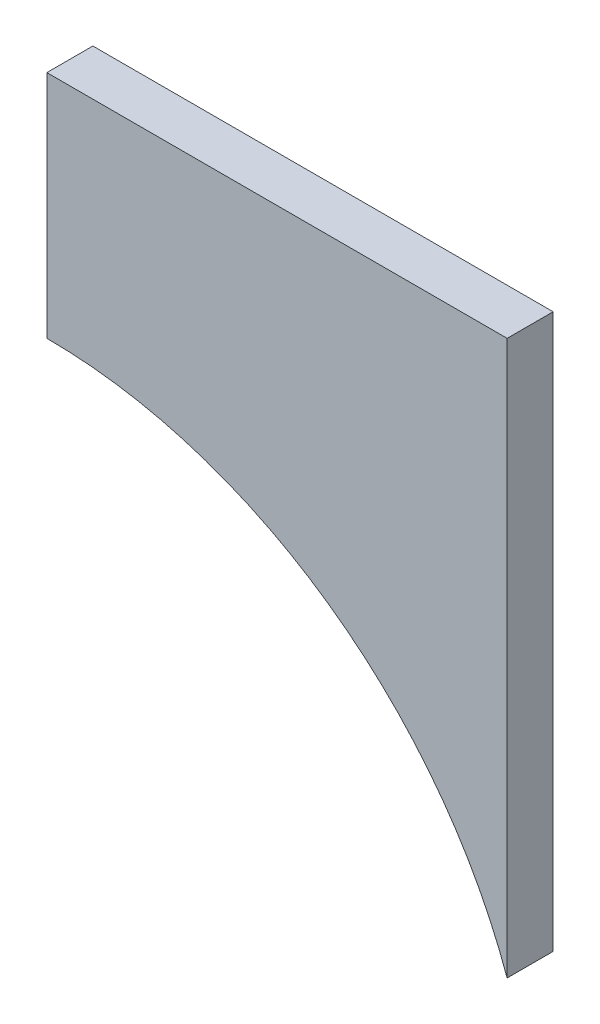
ISO-10303-21;
HEADER;
FILE_DESCRIPTION(('STEP AP214'),'2;1');
FILE_NAME('part.step','',(''),(''),'','','');
FILE_SCHEMA(('AUTOMOTIVE_DESIGN { 1 0 10303 214 1 1 1 1 }'));
ENDSEC;
DATA;
#1=APPLICATION_CONTEXT('core data for automotive mechanical design processes');
#2=APPLICATION_PROTOCOL_DEFINITION('international standard','automotive_design',2000,#1);
#3=PRODUCT_CONTEXT('',#1,'mechanical');
#4=PRODUCT('Part','Part','',(#3));
#5=PRODUCT_RELATED_PRODUCT_CATEGORY('part','',(#4));
#6=PRODUCT_DEFINITION_FORMATION('','',#4);
#7=PRODUCT_DEFINITION_CONTEXT('part definition',#1,'design');
#8=PRODUCT_DEFINITION('design','',#6,#7);
#9=PRODUCT_DEFINITION_SHAPE('','',#8);
#10=(LENGTH_UNIT() NAMED_UNIT(*) SI_UNIT(.MILLI.,.METRE.));
#11=(NAMED_UNIT(*) PLANE_ANGLE_UNIT() SI_UNIT($,.RADIAN.));
#12=(NAMED_UNIT(*) SI_UNIT($,.STERADIAN.) SOLID_ANGLE_UNIT());
#13=UNCERTAINTY_MEASURE_WITH_UNIT(LENGTH_MEASURE(1.E-05),#10,'distance_accuracy_value','');
#14=(GEOMETRIC_REPRESENTATION_CONTEXT(3) GLOBAL_UNCERTAINTY_ASSIGNED_CONTEXT((#13)) GLOBAL_UNIT_ASSIGNED_CONTEXT((#10,
#11,#12)) REPRESENTATION_CONTEXT('',''));
#15=CARTESIAN_POINT('',(0.,0.,0.));
#16=DIRECTION('',(0.,0.,1.));
#17=DIRECTION('',(1.,0.,0.));
#18=AXIS2_PLACEMENT_3D('',#15,#16,#17);
#19=CARTESIAN_POINT('',(-0.2,-0.525,0.));
#20=DIRECTION('',(0.,0.,-1.));
#21=DIRECTION('',(-1.,0.,0.));
#22=AXIS2_PLACEMENT_3D('',#19,#20,#21);
#23=PLANE('',#22);
#24=DIRECTION('',(1.,0.,0.));
#25=VECTOR('',#24,1.);
#26=CARTESIAN_POINT('',(0.2,0.1,0.));
#27=LINE('',#26,#25);
#28=CARTESIAN_POINT('',(-0.2,0.1,0.));
#29=VERTEX_POINT('',#28);
#30=CARTESIAN_POINT('',(0.2,0.1,0.));
#31=VERTEX_POINT('',#30);
#32=EDGE_CURVE('E61',#29,#31,#27,.T.);
#33=ORIENTED_EDGE('',*,*,#32,.T.);
#34=DIRECTION('',(0.,-1.,0.));
#35=VECTOR('',#34,1.);
#36=CARTESIAN_POINT('',(0.2,-0.381385933837,0.));
#37=LINE('',#36,#35);
#38=CARTESIAN_POINT('',(0.200000000000072,-0.381385933836749,0.));
#39=VERTEX_POINT('',#38);
#40=EDGE_CURVE('E50',#31,#39,#37,.T.);
#41=ORIENTED_EDGE('',*,*,#40,.T.);
#42=CARTESIAN_POINT('',(-0.2,-0.525,0.));
#43=DIRECTION('',(0.,0.,1.));
#44=DIRECTION('',(1.,0.,0.));
#45=AXIS2_PLACEMENT_3D('',#42,#43,#44);
#46=CIRCLE('',#45,0.425);
#47=CARTESIAN_POINT('',(-0.2,-0.1,0.));
#48=VERTEX_POINT('',#47);
#49=EDGE_CURVE('E20',#39,#48,#46,.T.);
#50=ORIENTED_EDGE('',*,*,#49,.T.);
#51=DIRECTION('',(0.,1.,0.));
#52=VECTOR('',#51,1.);
#53=CARTESIAN_POINT('',(-0.2,0.1,0.));
#54=LINE('',#53,#52);
#55=EDGE_CURVE('E57',#48,#29,#54,.T.);
#56=ORIENTED_EDGE('',*,*,#55,.T.);
#57=EDGE_LOOP('',(#33,#41,#50,#56));
#58=FACE_BOUND('',#57,.T.);
#59=ADVANCED_FACE('F17',(#58),#23,.T.);
#60=CARTESIAN_POINT('',(-0.2,0.1,0.04));
#61=DIRECTION('',(1.,0.,0.));
#62=DIRECTION('',(0.,0.,-1.));
#63=AXIS2_PLACEMENT_3D('',#60,#61,#62);
#64=PLANE('',#63);
#65=DIRECTION('',(0.,0.,1.));
#66=VECTOR('',#65,1.);
#67=CARTESIAN_POINT('',(-0.2,-0.1,0.04));
#68=LINE('',#67,#66);
#69=CARTESIAN_POINT('',(-0.2,-0.1,0.04));
#70=VERTEX_POINT('',#69);
#71=EDGE_CURVE('E79',#48,#70,#68,.T.);
#72=ORIENTED_EDGE('',*,*,#71,.T.);
#73=DIRECTION('',(0.,1.,0.));
#74=VECTOR('',#73,1.);
#75=CARTESIAN_POINT('',(-0.2,-0.525,0.04));
#76=LINE('',#75,#74);
#77=CARTESIAN_POINT('',(-0.2,0.1,0.04));
#78=VERTEX_POINT('',#77);
#79=EDGE_CURVE('E75',#70,#78,#76,.T.);
#80=ORIENTED_EDGE('',*,*,#79,.T.);
#81=DIRECTION('',(0.,0.,1.));
#82=VECTOR('',#81,1.);
#83=CARTESIAN_POINT('',(-0.2,0.1,0.04));
#84=LINE('',#83,#82);
#85=EDGE_CURVE('E65',#78,#29,#84,.F.);
#86=ORIENTED_EDGE('',*,*,#85,.T.);
#87=ORIENTED_EDGE('',*,*,#55,.F.);
#88=EDGE_LOOP('',(#72,#80,#86,#87));
#89=FACE_BOUND('',#88,.T.);
#90=ADVANCED_FACE('F78',(#89),#64,.F.);
#91=CARTESIAN_POINT('',(0.2,0.1,0.04));
#92=DIRECTION('',(0.,-1.,0.));
#93=DIRECTION('',(1.,0.,0.));
#94=AXIS2_PLACEMENT_3D('',#91,#92,#93);
#95=PLANE('',#94);
#96=ORIENTED_EDGE('',*,*,#85,.F.);
#97=DIRECTION('',(-1.,0.,0.));
#98=VECTOR('',#97,1.);
#99=CARTESIAN_POINT('',(-0.2,0.1,0.04));
#100=LINE('',#99,#98);
#101=CARTESIAN_POINT('',(0.2,0.1,0.04));
#102=VERTEX_POINT('',#101);
#103=EDGE_CURVE('E69',#78,#102,#100,.F.);
#104=ORIENTED_EDGE('',*,*,#103,.T.);
#105=DIRECTION('',(0.,0.,1.));
#106=VECTOR('',#105,1.);
#107=CARTESIAN_POINT('',(0.2,0.1,0.04));
#108=LINE('',#107,#106);
#109=EDGE_CURVE('E89',#102,#31,#108,.F.);
#110=ORIENTED_EDGE('',*,*,#109,.T.);
#111=ORIENTED_EDGE('',*,*,#32,.F.);
#112=EDGE_LOOP('',(#96,#104,#110,#111));
#113=FACE_BOUND('',#112,.T.);
#114=ADVANCED_FACE('F67',(#113),#95,.F.);
#115=CARTESIAN_POINT('',(0.2,-0.381385933837,0.04));
#116=DIRECTION('',(-1.,0.,0.));
#117=DIRECTION('',(0.,-1.,0.));
#118=AXIS2_PLACEMENT_3D('',#115,#116,#117);
#119=PLANE('',#118);
#120=ORIENTED_EDGE('',*,*,#109,.F.);
#121=DIRECTION('',(0.,1.,0.));
#122=VECTOR('',#121,1.);
#123=CARTESIAN_POINT('',(0.2,-0.525,0.04));
#124=LINE('',#123,#122);
#125=CARTESIAN_POINT('',(0.200000000000072,-0.381385933836749,0.04));
#126=VERTEX_POINT('',#125);
#127=EDGE_CURVE('E26',#102,#126,#124,.F.);
#128=ORIENTED_EDGE('',*,*,#127,.T.);
#129=DIRECTION('',(0.,0.,1.));
#130=VECTOR('',#129,1.);
#131=CARTESIAN_POINT('',(0.200000000000143,-0.381385933836949,0.04));
#132=LINE('',#131,#130);
#133=EDGE_CURVE('E33',#126,#39,#132,.F.);
#134=ORIENTED_EDGE('',*,*,#133,.T.);
#135=ORIENTED_EDGE('',*,*,#40,.F.);
#136=EDGE_LOOP('',(#120,#128,#134,#135));
#137=FACE_BOUND('',#136,.T.);
#138=ADVANCED_FACE('F107',(#137),#119,.F.);
#139=CARTESIAN_POINT('',(-0.2,-0.525,0.04));
#140=DIRECTION('',(0.,0.,1.));
#141=DIRECTION('',(1.,0.,0.));
#142=AXIS2_PLACEMENT_3D('',#139,#140,#141);
#143=CYLINDRICAL_SURFACE('',#142,0.425);
#144=ORIENTED_EDGE('',*,*,#133,.F.);
#145=CARTESIAN_POINT('',(-0.2,-0.525,0.04));
#146=DIRECTION('',(0.,0.,1.));
#147=DIRECTION('',(1.,0.,0.));
#148=AXIS2_PLACEMENT_3D('',#145,#146,#147);
#149=CIRCLE('',#148,0.425);
#150=EDGE_CURVE('E11',#126,#70,#149,.T.);
#151=ORIENTED_EDGE('',*,*,#150,.T.);
#152=ORIENTED_EDGE('',*,*,#71,.F.);
#153=ORIENTED_EDGE('',*,*,#49,.F.);
#154=EDGE_LOOP('',(#144,#151,#152,#153));
#155=FACE_BOUND('',#154,.T.);
#156=ADVANCED_FACE('F105',(#155),#143,.F.);
#157=CARTESIAN_POINT('',(-0.2,-0.525,0.04));
#158=DIRECTION('',(0.,0.,-1.));
#159=DIRECTION('',(-1.,0.,0.));
#160=AXIS2_PLACEMENT_3D('',#157,#158,#159);
#161=PLANE('',#160);
#162=ORIENTED_EDGE('',*,*,#127,.F.);
#163=ORIENTED_EDGE('',*,*,#103,.F.);
#164=ORIENTED_EDGE('',*,*,#79,.F.);
#165=ORIENTED_EDGE('',*,*,#150,.F.);
#166=EDGE_LOOP('',(#162,#163,#164,#165));
#167=FACE_BOUND('',#166,.T.);
#168=ADVANCED_FACE('F74',(#167),#161,.F.);
#169=CLOSED_SHELL('',(#59,#90,#114,#138,#156,#168));
#170=MANIFOLD_SOLID_BREP('B1',#169);
#171=ADVANCED_BREP_SHAPE_REPRESENTATION('',(#18,#170),#14);
#172=SHAPE_DEFINITION_REPRESENTATION(#9,#171);
ENDSEC;
END-ISO-10303-21;
